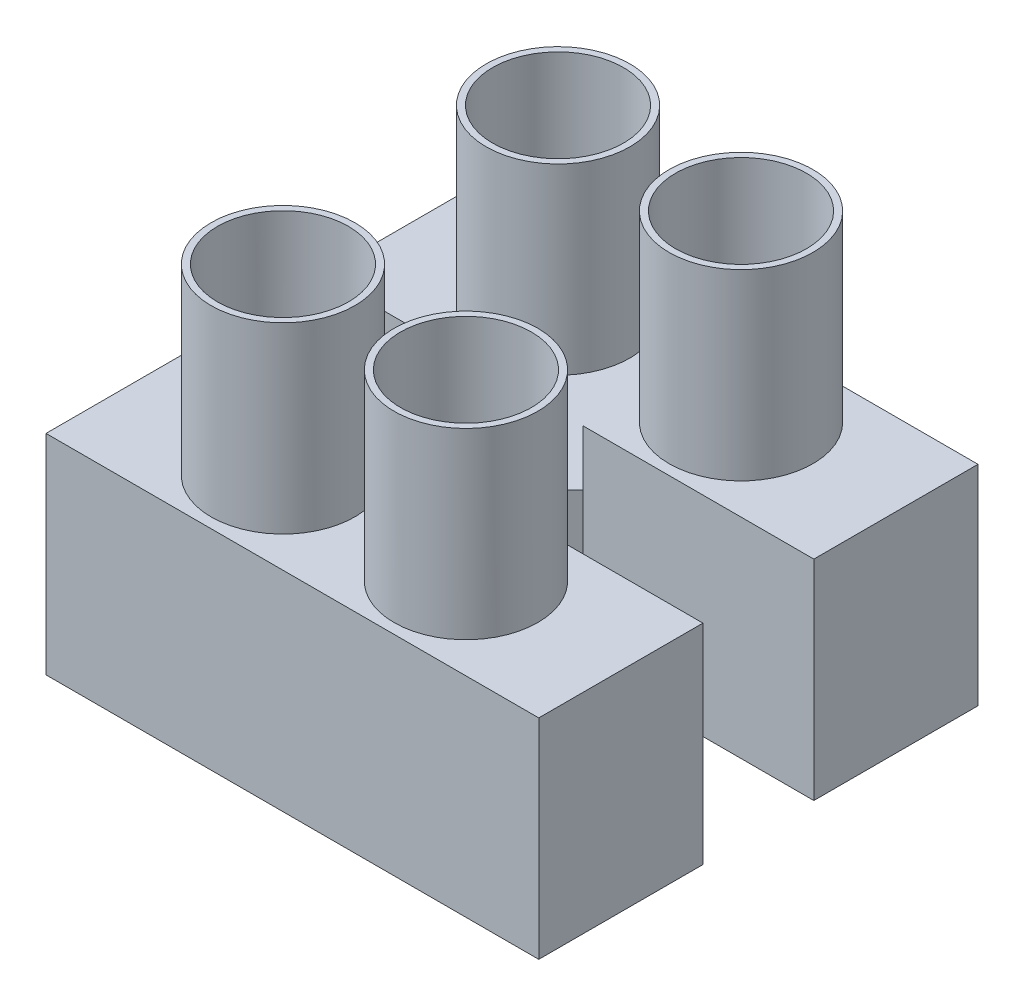
ISO-10303-21;
HEADER;
FILE_DESCRIPTION(('STEP AP214'),'2;1');
FILE_NAME('part.step','',(''),(''),'','','');
FILE_SCHEMA(('AUTOMOTIVE_DESIGN { 1 0 10303 214 1 1 1 1 }'));
ENDSEC;
DATA;
#1=APPLICATION_CONTEXT('core data for automotive mechanical design processes');
#2=APPLICATION_PROTOCOL_DEFINITION('international standard','automotive_design',2000,#1);
#3=PRODUCT_CONTEXT('',#1,'mechanical');
#4=PRODUCT('Part','Part','',(#3));
#5=PRODUCT_RELATED_PRODUCT_CATEGORY('part','',(#4));
#6=PRODUCT_DEFINITION_FORMATION('','',#4);
#7=PRODUCT_DEFINITION_CONTEXT('part definition',#1,'design');
#8=PRODUCT_DEFINITION('design','',#6,#7);
#9=PRODUCT_DEFINITION_SHAPE('','',#8);
#10=(LENGTH_UNIT() NAMED_UNIT(*) SI_UNIT(.MILLI.,.METRE.));
#11=(NAMED_UNIT(*) PLANE_ANGLE_UNIT() SI_UNIT($,.RADIAN.));
#12=(NAMED_UNIT(*) SI_UNIT($,.STERADIAN.) SOLID_ANGLE_UNIT());
#13=UNCERTAINTY_MEASURE_WITH_UNIT(LENGTH_MEASURE(1.E-05),#10,'distance_accuracy_value','');
#14=(GEOMETRIC_REPRESENTATION_CONTEXT(3) GLOBAL_UNCERTAINTY_ASSIGNED_CONTEXT((#13)) GLOBAL_UNIT_ASSIGNED_CONTEXT((#10,
#11,#12)) REPRESENTATION_CONTEXT('',''));
#15=CARTESIAN_POINT('',(0.,0.,0.));
#16=DIRECTION('',(0.,0.,1.));
#17=DIRECTION('',(1.,0.,0.));
#18=AXIS2_PLACEMENT_3D('',#15,#16,#17);
#19=CARTESIAN_POINT('',(0.,8.,-8.67493798441658));
#20=DIRECTION('',(0.,0.,-1.));
#21=DIRECTION('',(-1.,0.,0.));
#22=AXIS2_PLACEMENT_3D('',#19,#20,#21);
#23=PLANE('',#22);
#24=DIRECTION('',(0.,-1.,0.));
#25=VECTOR('',#24,1.);
#26=CARTESIAN_POINT('',(0.345270270270276,8.,-8.67493798441658));
#27=LINE('',#26,#25);
#28=CARTESIAN_POINT('',(0.345270270270276,8.,-8.67493798441658));
#29=VERTEX_POINT('',#28);
#30=CARTESIAN_POINT('',(0.345270270270276,0.,-8.67493798441658));
#31=VERTEX_POINT('',#30);
#32=EDGE_CURVE('E235',#29,#31,#27,.T.);
#33=ORIENTED_EDGE('',*,*,#32,.T.);
#34=DIRECTION('',(1.,0.,0.));
#35=VECTOR('',#34,1.);
#36=CARTESIAN_POINT('',(0.,0.,-8.67493798441658));
#37=LINE('',#36,#35);
#38=CARTESIAN_POINT('',(9.17027027027028,0.,-8.67493798441658));
#39=VERTEX_POINT('',#38);
#40=EDGE_CURVE('E264',#31,#39,#37,.T.);
#41=ORIENTED_EDGE('',*,*,#40,.T.);
#42=DIRECTION('',(0.,-1.,0.));
#43=VECTOR('',#42,1.);
#44=CARTESIAN_POINT('',(9.17027027027028,8.,-8.67493798441658));
#45=LINE('',#44,#43);
#46=CARTESIAN_POINT('',(9.17027027027028,8.,-8.67493798441658));
#47=VERTEX_POINT('',#46);
#48=EDGE_CURVE('E276',#47,#39,#45,.T.);
#49=ORIENTED_EDGE('',*,*,#48,.F.);
#50=DIRECTION('',(1.,0.,0.));
#51=VECTOR('',#50,1.);
#52=CARTESIAN_POINT('',(0.,8.,-8.67493798441658));
#53=LINE('',#52,#51);
#54=EDGE_CURVE('E90',#29,#47,#53,.T.);
#55=ORIENTED_EDGE('',*,*,#54,.F.);
#56=EDGE_LOOP('',(#33,#41,#49,#55));
#57=FACE_BOUND('',#56,.T.);
#58=ADVANCED_FACE('F73',(#57),#23,.F.);
#59=CARTESIAN_POINT('',(-9.67972972972973,8.,-4.4322972972973));
#60=DIRECTION('',(0.,0.,-1.));
#61=DIRECTION('',(-1.,0.,0.));
#62=AXIS2_PLACEMENT_3D('',#59,#60,#61);
#63=PLANE('',#62);
#64=DIRECTION('',(1.,0.,0.));
#65=VECTOR('',#64,1.);
#66=CARTESIAN_POINT('',(-9.67972972972973,8.,-4.4322972972973));
#67=LINE('',#66,#65);
#68=CARTESIAN_POINT('',(-9.67972972972973,8.,-4.4322972972973));
#69=VERTEX_POINT('',#68);
#70=CARTESIAN_POINT('',(-0.854729729729725,8.,-4.4322972972973));
#71=VERTEX_POINT('',#70);
#72=EDGE_CURVE('E320',#69,#71,#67,.T.);
#73=ORIENTED_EDGE('',*,*,#72,.T.);
#74=DIRECTION('',(0.,-1.,0.));
#75=VECTOR('',#74,1.);
#76=CARTESIAN_POINT('',(-0.854729729729725,8.,-4.4322972972973));
#77=LINE('',#76,#75);
#78=CARTESIAN_POINT('',(-0.854729729729725,0.,-4.4322972972973));
#79=VERTEX_POINT('',#78);
#80=EDGE_CURVE('E303',#71,#79,#77,.T.);
#81=ORIENTED_EDGE('',*,*,#80,.T.);
#82=DIRECTION('',(1.,0.,0.));
#83=VECTOR('',#82,1.);
#84=CARTESIAN_POINT('',(-9.67972972972973,0.,-4.4322972972973));
#85=LINE('',#84,#83);
#86=CARTESIAN_POINT('',(-9.67972972972973,0.,-4.4322972972973));
#87=VERTEX_POINT('',#86);
#88=EDGE_CURVE('E314',#87,#79,#85,.T.);
#89=ORIENTED_EDGE('',*,*,#88,.F.);
#90=DIRECTION('',(0.,-1.,0.));
#91=VECTOR('',#90,1.);
#92=CARTESIAN_POINT('',(-9.67972972972973,8.,-4.4322972972973));
#93=LINE('',#92,#91);
#94=EDGE_CURVE('E323',#69,#87,#93,.T.);
#95=ORIENTED_EDGE('',*,*,#94,.F.);
#96=EDGE_LOOP('',(#73,#81,#89,#95));
#97=FACE_BOUND('',#96,.T.);
#98=ADVANCED_FACE('F418',(#97),#63,.T.);
#99=CARTESIAN_POINT('',(-9.67972972972973,8.,-4.4322972972973));
#100=DIRECTION('',(1.,0.,0.));
#101=DIRECTION('',(0.,0.,-1.));
#102=AXIS2_PLACEMENT_3D('',#99,#100,#101);
#103=PLANE('',#102);
#104=DIRECTION('',(0.,0.,1.));
#105=VECTOR('',#104,1.);
#106=CARTESIAN_POINT('',(-9.67972972972973,0.,-4.4322972972973));
#107=LINE('',#106,#105);
#108=CARTESIAN_POINT('',(-9.67972972972973,0.,1.8477027027027));
#109=VERTEX_POINT('',#108);
#110=EDGE_CURVE('E309',#87,#109,#107,.T.);
#111=ORIENTED_EDGE('',*,*,#110,.T.);
#112=DIRECTION('',(0.,-1.,0.));
#113=VECTOR('',#112,1.);
#114=CARTESIAN_POINT('',(-9.67972972972973,8.,1.8477027027027));
#115=LINE('',#114,#113);
#116=CARTESIAN_POINT('',(-9.67972972972973,8.,1.8477027027027));
#117=VERTEX_POINT('',#116);
#118=EDGE_CURVE('E77',#117,#109,#115,.T.);
#119=ORIENTED_EDGE('',*,*,#118,.F.);
#120=DIRECTION('',(0.,0.,1.));
#121=VECTOR('',#120,1.);
#122=CARTESIAN_POINT('',(-9.67972972972973,8.,-4.4322972972973));
#123=LINE('',#122,#121);
#124=EDGE_CURVE('E310',#69,#117,#123,.T.);
#125=ORIENTED_EDGE('',*,*,#124,.F.);
#126=ORIENTED_EDGE('',*,*,#94,.T.);
#127=EDGE_LOOP('',(#111,#119,#125,#126));
#128=FACE_BOUND('',#127,.T.);
#129=ADVANCED_FACE('F75',(#128),#103,.F.);
#130=CARTESIAN_POINT('',(-9.67972972972973,8.,1.8477027027027));
#131=DIRECTION('',(0.,0.,-1.));
#132=DIRECTION('',(-1.,0.,0.));
#133=AXIS2_PLACEMENT_3D('',#130,#131,#132);
#134=PLANE('',#133);
#135=DIRECTION('',(1.,0.,0.));
#136=VECTOR('',#135,1.);
#137=CARTESIAN_POINT('',(-9.67972972972973,0.,1.8477027027027));
#138=LINE('',#137,#136);
#139=CARTESIAN_POINT('',(9.17027027027028,0.,1.8477027027027));
#140=VERTEX_POINT('',#139);
#141=EDGE_CURVE('E326',#109,#140,#138,.T.);
#142=ORIENTED_EDGE('',*,*,#141,.T.);
#143=DIRECTION('',(0.,-1.,0.));
#144=VECTOR('',#143,1.);
#145=CARTESIAN_POINT('',(9.17027027027028,8.,1.8477027027027));
#146=LINE('',#145,#144);
#147=CARTESIAN_POINT('',(9.17027027027028,8.,1.8477027027027));
#148=VERTEX_POINT('',#147);
#149=EDGE_CURVE('E338',#148,#140,#146,.T.);
#150=ORIENTED_EDGE('',*,*,#149,.F.);
#151=DIRECTION('',(1.,0.,0.));
#152=VECTOR('',#151,1.);
#153=CARTESIAN_POINT('',(-9.67972972972973,8.,1.8477027027027));
#154=LINE('',#153,#152);
#155=EDGE_CURVE('E313',#117,#148,#154,.T.);
#156=ORIENTED_EDGE('',*,*,#155,.F.);
#157=ORIENTED_EDGE('',*,*,#118,.T.);
#158=EDGE_LOOP('',(#142,#150,#156,#157));
#159=FACE_BOUND('',#158,.T.);
#160=ADVANCED_FACE('F464',(#159),#134,.F.);
#161=CARTESIAN_POINT('',(9.17027027027028,8.,-4.4322972972973));
#162=DIRECTION('',(1.,0.,0.));
#163=DIRECTION('',(0.,0.,-1.));
#164=AXIS2_PLACEMENT_3D('',#161,#162,#163);
#165=PLANE('',#164);
#166=DIRECTION('',(0.,0.,1.));
#167=VECTOR('',#166,1.);
#168=CARTESIAN_POINT('',(9.17027027027028,0.,-4.4322972972973));
#169=LINE('',#168,#167);
#170=CARTESIAN_POINT('',(9.17027027027028,0.,-4.4322972972973));
#171=VERTEX_POINT('',#170);
#172=EDGE_CURVE('E329',#171,#140,#169,.T.);
#173=ORIENTED_EDGE('',*,*,#172,.F.);
#174=DIRECTION('',(0.,-1.,0.));
#175=VECTOR('',#174,1.);
#176=CARTESIAN_POINT('',(9.17027027027028,8.,-4.4322972972973));
#177=LINE('',#176,#175);
#178=CARTESIAN_POINT('',(9.17027027027028,8.,-4.4322972972973));
#179=VERTEX_POINT('',#178);
#180=EDGE_CURVE('E336',#179,#171,#177,.T.);
#181=ORIENTED_EDGE('',*,*,#180,.F.);
#182=DIRECTION('',(0.,0.,1.));
#183=VECTOR('',#182,1.);
#184=CARTESIAN_POINT('',(9.17027027027028,8.,-4.4322972972973));
#185=LINE('',#184,#183);
#186=EDGE_CURVE('E316',#179,#148,#185,.T.);
#187=ORIENTED_EDGE('',*,*,#186,.T.);
#188=ORIENTED_EDGE('',*,*,#149,.T.);
#189=EDGE_LOOP('',(#173,#181,#187,#188));
#190=FACE_BOUND('',#189,.T.);
#191=ADVANCED_FACE('F467',(#190),#165,.T.);
#192=DIRECTION('',(0.,-1.,0.));
#193=VECTOR('',#192,1.);
#194=CARTESIAN_POINT('',(0.345270270270275,8.,-4.4322972972973));
#195=LINE('',#194,#193);
#196=CARTESIAN_POINT('',(0.345270270270275,8.,-4.4322972972973));
#197=VERTEX_POINT('',#196);
#198=CARTESIAN_POINT('',(0.345270270270275,0.,-4.4322972972973));
#199=VERTEX_POINT('',#198);
#200=EDGE_CURVE('E223',#197,#199,#195,.T.);
#201=ORIENTED_EDGE('',*,*,#200,.F.);
#202=EDGE_CURVE('E319',#197,#179,#67,.T.);
#203=ORIENTED_EDGE('',*,*,#202,.T.);
#204=ORIENTED_EDGE('',*,*,#180,.T.);
#205=EDGE_CURVE('E332',#199,#171,#85,.T.);
#206=ORIENTED_EDGE('',*,*,#205,.F.);
#207=EDGE_LOOP('',(#201,#203,#204,#206));
#208=FACE_BOUND('',#207,.T.);
#209=ADVANCED_FACE('F426',(#208),#63,.T.);
#210=CARTESIAN_POINT('',(0.,8.,0.));
#211=DIRECTION('',(0.,1.,0.));
#212=DIRECTION('',(0.,0.,1.));
#213=AXIS2_PLACEMENT_3D('',#210,#211,#212);
#214=PLANE('',#213);
#215=CARTESIAN_POINT('',(-3.75472972972973,8.,-1.2922972972973));
#216=DIRECTION('',(0.,1.,0.));
#217=DIRECTION('',(0.,0.,1.));
#218=AXIS2_PLACEMENT_3D('',#215,#216,#217);
#219=CIRCLE('',#218,2.75);
#220=CARTESIAN_POINT('',(-3.75472972972973,8.,1.4577027027027));
#221=VERTEX_POINT('',#220);
#222=EDGE_CURVE('E387',#221,#221,#219,.F.);
#223=ORIENTED_EDGE('',*,*,#222,.T.);
#224=EDGE_LOOP('',(#223));
#225=FACE_BOUND('',#224,.T.);
#226=CARTESIAN_POINT('',(3.24527027027027,8.,-1.29229729729729));
#227=DIRECTION('',(0.,1.,0.));
#228=DIRECTION('',(0.,0.,1.));
#229=AXIS2_PLACEMENT_3D('',#226,#227,#228);
#230=CIRCLE('',#229,2.75);
#231=CARTESIAN_POINT('',(3.24527027027027,8.,1.45770270270271));
#232=VERTEX_POINT('',#231);
#233=EDGE_CURVE('E82',#232,#232,#230,.T.);
#234=ORIENTED_EDGE('',*,*,#233,.F.);
#235=EDGE_LOOP('',(#234));
#236=FACE_BOUND('',#235,.T.);
#237=CARTESIAN_POINT('',(-3.75472972972973,8.,-11.8149379844166));
#238=DIRECTION('',(0.,1.,0.));
#239=DIRECTION('',(0.,0.,1.));
#240=AXIS2_PLACEMENT_3D('',#237,#238,#239);
#241=CIRCLE('',#240,2.75);
#242=CARTESIAN_POINT('',(-3.75472972972973,8.,-9.06493798441658));
#243=VERTEX_POINT('',#242);
#244=EDGE_CURVE('E347',#243,#243,#241,.T.);
#245=ORIENTED_EDGE('',*,*,#244,.F.);
#246=EDGE_LOOP('',(#245));
#247=FACE_BOUND('',#246,.T.);
#248=CARTESIAN_POINT('',(3.24527027027027,8.,-11.8149379844166));
#249=DIRECTION('',(0.,1.,0.));
#250=DIRECTION('',(0.,0.,1.));
#251=AXIS2_PLACEMENT_3D('',#248,#249,#250);
#252=CIRCLE('',#251,2.75);
#253=CARTESIAN_POINT('',(3.24527027027027,8.,-9.06493798441658));
#254=VERTEX_POINT('',#253);
#255=EDGE_CURVE('E238',#254,#254,#252,.F.);
#256=ORIENTED_EDGE('',*,*,#255,.T.);
#257=EDGE_LOOP('',(#256));
#258=FACE_BOUND('',#257,.T.);
#259=ORIENTED_EDGE('',*,*,#202,.F.);
#260=DIRECTION('',(-0.707106781186547,0.,0.707106781186548));
#261=VECTOR('',#260,1.);
#262=CARTESIAN_POINT('',(-2.04351351351351,8.,-2.04351351351351));
#263=LINE('',#262,#261);
#264=CARTESIAN_POINT('',(2.46659061382992,8.,-6.55361764085694));
#265=VERTEX_POINT('',#264);
#266=EDGE_CURVE('E228',#265,#197,#263,.T.);
#267=ORIENTED_EDGE('',*,*,#266,.F.);
#268=DIRECTION('',(-0.707106781186547,0.,-0.707106781186548));
#269=VECTOR('',#268,1.);
#270=CARTESIAN_POINT('',(4.51010412734343,8.,-4.51010412734343));
#271=LINE('',#270,#269);
#272=EDGE_CURVE('E230',#265,#29,#271,.T.);
#273=ORIENTED_EDGE('',*,*,#272,.T.);
#274=ORIENTED_EDGE('',*,*,#54,.T.);
#275=DIRECTION('',(0.,0.,-1.));
#276=VECTOR('',#275,1.);
#277=CARTESIAN_POINT('',(9.17027027027028,8.,0.));
#278=LINE('',#277,#276);
#279=CARTESIAN_POINT('',(9.17027027027028,8.,-14.9549379844166));
#280=VERTEX_POINT('',#279);
#281=EDGE_CURVE('E256',#47,#280,#278,.T.);
#282=ORIENTED_EDGE('',*,*,#281,.T.);
#283=DIRECTION('',(1.,0.,0.));
#284=VECTOR('',#283,1.);
#285=CARTESIAN_POINT('',(0.,8.,-14.9549379844166));
#286=LINE('',#285,#284);
#287=CARTESIAN_POINT('',(-9.67972972972973,8.,-14.9549379844166));
#288=VERTEX_POINT('',#287);
#289=EDGE_CURVE('E258',#288,#280,#286,.T.);
#290=ORIENTED_EDGE('',*,*,#289,.F.);
#291=DIRECTION('',(0.,0.,-1.));
#292=VECTOR('',#291,1.);
#293=CARTESIAN_POINT('',(-9.67972972972973,8.,0.));
#294=LINE('',#293,#292);
#295=CARTESIAN_POINT('',(-9.67972972972973,8.,-8.67493798441658));
#296=VERTEX_POINT('',#295);
#297=EDGE_CURVE('E249',#296,#288,#294,.T.);
#298=ORIENTED_EDGE('',*,*,#297,.F.);
#299=CARTESIAN_POINT('',(-0.854729729729725,8.,-8.67493798441658));
#300=VERTEX_POINT('',#299);
#301=EDGE_CURVE('E253',#296,#300,#53,.T.);
#302=ORIENTED_EDGE('',*,*,#301,.T.);
#303=DIRECTION('',(0.707106781186547,0.,-0.707106781186548));
#304=VECTOR('',#303,1.);
#305=CARTESIAN_POINT('',(-4.76483385707315,8.,-4.76483385707315));
#306=LINE('',#305,#304);
#307=CARTESIAN_POINT('',(-2.97605007328937,8.,-6.55361764085694));
#308=VERTEX_POINT('',#307);
#309=EDGE_CURVE('E282',#308,#300,#306,.T.);
#310=ORIENTED_EDGE('',*,*,#309,.F.);
#311=DIRECTION('',(0.707106781186547,0.,0.707106781186548));
#312=VECTOR('',#311,1.);
#313=CARTESIAN_POINT('',(1.78878378378378,8.,-1.78878378378378));
#314=LINE('',#313,#312);
#315=EDGE_CURVE('E284',#308,#71,#314,.T.);
#316=ORIENTED_EDGE('',*,*,#315,.T.);
#317=ORIENTED_EDGE('',*,*,#72,.F.);
#318=ORIENTED_EDGE('',*,*,#124,.T.);
#319=ORIENTED_EDGE('',*,*,#155,.T.);
#320=ORIENTED_EDGE('',*,*,#186,.F.);
#321=EDGE_LOOP('',(#259,#267,#273,#274,#282,#290,#298,#302,#310,#316,#317,#318,#319,#320));
#322=FACE_BOUND('',#321,.T.);
#323=DIRECTION('',(0.707106781186547,0.,-0.707106781186548));
#324=VECTOR('',#323,1.);
#325=CARTESIAN_POINT('',(-2.34351351351351,8.,-2.34351351351351));
#326=LINE('',#325,#324);
#327=CARTESIAN_POINT('',(-0.254729729729725,8.,-4.4322972972973));
#328=VERTEX_POINT('',#327);
#329=CARTESIAN_POINT('',(1.86659061382992,8.,-6.55361764085694));
#330=VERTEX_POINT('',#329);
#331=EDGE_CURVE('E207',#328,#330,#326,.T.);
#332=ORIENTED_EDGE('',*,*,#331,.F.);
#333=DIRECTION('',(-0.707106781186547,0.,-0.707106781186548));
#334=VECTOR('',#333,1.);
#335=CARTESIAN_POINT('',(2.08878378378379,8.,-2.08878378378378));
#336=LINE('',#335,#334);
#337=CARTESIAN_POINT('',(-2.37605007328937,8.,-6.55361764085694));
#338=VERTEX_POINT('',#337);
#339=EDGE_CURVE('E287',#328,#338,#336,.T.);
#340=ORIENTED_EDGE('',*,*,#339,.T.);
#341=DIRECTION('',(-0.707106781186548,0.,0.707106781186548));
#342=VECTOR('',#341,1.);
#343=CARTESIAN_POINT('',(-4.46483385707315,8.,-4.46483385707315));
#344=LINE('',#343,#342);
#345=CARTESIAN_POINT('',(-0.254729729729725,8.,-8.67493798441658));
#346=VERTEX_POINT('',#345);
#347=EDGE_CURVE('E210',#346,#338,#344,.T.);
#348=ORIENTED_EDGE('',*,*,#347,.F.);
#349=DIRECTION('',(0.707106781186548,0.,0.707106781186548));
#350=VECTOR('',#349,1.);
#351=CARTESIAN_POINT('',(4.21010412734343,8.,-4.21010412734343));
#352=LINE('',#351,#350);
#353=EDGE_CURVE('E203',#346,#330,#352,.T.);
#354=ORIENTED_EDGE('',*,*,#353,.T.);
#355=EDGE_LOOP('',(#332,#340,#348,#354));
#356=FACE_BOUND('',#355,.T.);
#357=ADVANCED_FACE('F205',(#225,#236,#247,#258,#322,#356),#214,.T.);
#358=CARTESIAN_POINT('',(0.,0.,0.));
#359=DIRECTION('',(0.,1.,0.));
#360=DIRECTION('',(0.,0.,1.));
#361=AXIS2_PLACEMENT_3D('',#358,#359,#360);
#362=PLANE('',#361);
#363=DIRECTION('',(-0.707106781186547,0.,0.707106781186548));
#364=VECTOR('',#363,1.);
#365=CARTESIAN_POINT('',(-2.04351351351351,0.,-2.04351351351351));
#366=LINE('',#365,#364);
#367=CARTESIAN_POINT('',(2.46659061382992,0.,-6.55361764085694));
#368=VERTEX_POINT('',#367);
#369=EDGE_CURVE('E240',#368,#199,#366,.T.);
#370=ORIENTED_EDGE('',*,*,#369,.T.);
#371=ORIENTED_EDGE('',*,*,#205,.T.);
#372=ORIENTED_EDGE('',*,*,#172,.T.);
#373=ORIENTED_EDGE('',*,*,#141,.F.);
#374=ORIENTED_EDGE('',*,*,#110,.F.);
#375=ORIENTED_EDGE('',*,*,#88,.T.);
#376=DIRECTION('',(0.707106781186547,0.,0.707106781186548));
#377=VECTOR('',#376,1.);
#378=CARTESIAN_POINT('',(1.78878378378378,0.,-1.78878378378378));
#379=LINE('',#378,#377);
#380=CARTESIAN_POINT('',(-2.97605007328937,0.,-6.55361764085694));
#381=VERTEX_POINT('',#380);
#382=EDGE_CURVE('E98',#381,#79,#379,.T.);
#383=ORIENTED_EDGE('',*,*,#382,.F.);
#384=DIRECTION('',(0.707106781186547,0.,-0.707106781186548));
#385=VECTOR('',#384,1.);
#386=CARTESIAN_POINT('',(-4.76483385707315,0.,-4.76483385707315));
#387=LINE('',#386,#385);
#388=CARTESIAN_POINT('',(-0.854729729729725,0.,-8.67493798441658));
#389=VERTEX_POINT('',#388);
#390=EDGE_CURVE('E281',#381,#389,#387,.T.);
#391=ORIENTED_EDGE('',*,*,#390,.T.);
#392=CARTESIAN_POINT('',(-9.67972972972973,0.,-8.67493798441658));
#393=VERTEX_POINT('',#392);
#394=EDGE_CURVE('E265',#393,#389,#37,.T.);
#395=ORIENTED_EDGE('',*,*,#394,.F.);
#396=DIRECTION('',(0.,0.,-1.));
#397=VECTOR('',#396,1.);
#398=CARTESIAN_POINT('',(-9.67972972972973,0.,0.));
#399=LINE('',#398,#397);
#400=CARTESIAN_POINT('',(-9.67972972972973,0.,-14.9549379844166));
#401=VERTEX_POINT('',#400);
#402=EDGE_CURVE('E222',#393,#401,#399,.T.);
#403=ORIENTED_EDGE('',*,*,#402,.T.);
#404=DIRECTION('',(1.,0.,0.));
#405=VECTOR('',#404,1.);
#406=CARTESIAN_POINT('',(0.,0.,-14.9549379844166));
#407=LINE('',#406,#405);
#408=CARTESIAN_POINT('',(9.17027027027028,0.,-14.9549379844166));
#409=VERTEX_POINT('',#408);
#410=EDGE_CURVE('E252',#401,#409,#407,.T.);
#411=ORIENTED_EDGE('',*,*,#410,.T.);
#412=DIRECTION('',(0.,0.,-1.));
#413=VECTOR('',#412,1.);
#414=CARTESIAN_POINT('',(9.17027027027028,0.,0.));
#415=LINE('',#414,#413);
#416=EDGE_CURVE('E268',#39,#409,#415,.T.);
#417=ORIENTED_EDGE('',*,*,#416,.F.);
#418=ORIENTED_EDGE('',*,*,#40,.F.);
#419=DIRECTION('',(-0.707106781186547,0.,-0.707106781186548));
#420=VECTOR('',#419,1.);
#421=CARTESIAN_POINT('',(4.51010412734343,0.,-4.51010412734343));
#422=LINE('',#421,#420);
#423=EDGE_CURVE('E213',#368,#31,#422,.T.);
#424=ORIENTED_EDGE('',*,*,#423,.F.);
#425=EDGE_LOOP('',(#370,#371,#372,#373,#374,#375,#383,#391,#395,#403,#411,#417,#418,#424));
#426=FACE_BOUND('',#425,.T.);
#427=DIRECTION('',(-0.707106781186547,0.,-0.707106781186548));
#428=VECTOR('',#427,1.);
#429=CARTESIAN_POINT('',(2.08878378378379,0.,-2.08878378378378));
#430=LINE('',#429,#428);
#431=CARTESIAN_POINT('',(-0.254729729729725,0.,-4.4322972972973));
#432=VERTEX_POINT('',#431);
#433=CARTESIAN_POINT('',(-2.37605007328937,0.,-6.55361764085694));
#434=VERTEX_POINT('',#433);
#435=EDGE_CURVE('E294',#432,#434,#430,.T.);
#436=ORIENTED_EDGE('',*,*,#435,.F.);
#437=DIRECTION('',(0.707106781186547,0.,-0.707106781186548));
#438=VECTOR('',#437,1.);
#439=CARTESIAN_POINT('',(-2.34351351351351,0.,-2.34351351351351));
#440=LINE('',#439,#438);
#441=CARTESIAN_POINT('',(1.86659061382992,0.,-6.55361764085694));
#442=VERTEX_POINT('',#441);
#443=EDGE_CURVE('E237',#432,#442,#440,.T.);
#444=ORIENTED_EDGE('',*,*,#443,.T.);
#445=DIRECTION('',(0.707106781186548,0.,0.707106781186548));
#446=VECTOR('',#445,1.);
#447=CARTESIAN_POINT('',(4.21010412734343,0.,-4.21010412734343));
#448=LINE('',#447,#446);
#449=CARTESIAN_POINT('',(-0.254729729729725,0.,-8.67493798441658));
#450=VERTEX_POINT('',#449);
#451=EDGE_CURVE('E219',#450,#442,#448,.T.);
#452=ORIENTED_EDGE('',*,*,#451,.F.);
#453=DIRECTION('',(-0.707106781186548,0.,0.707106781186548));
#454=VECTOR('',#453,1.);
#455=CARTESIAN_POINT('',(-4.46483385707315,0.,-4.46483385707315));
#456=LINE('',#455,#454);
#457=EDGE_CURVE('E285',#450,#434,#456,.T.);
#458=ORIENTED_EDGE('',*,*,#457,.T.);
#459=EDGE_LOOP('',(#436,#444,#452,#458));
#460=FACE_BOUND('',#459,.T.);
#461=ADVANCED_FACE('F453',(#426,#460),#362,.F.);
#462=CARTESIAN_POINT('',(-4.76483385707315,8.,-4.76483385707315));
#463=DIRECTION('',(-0.707106781186548,0.,-0.707106781186547));
#464=DIRECTION('',(-0.707106781186547,0.,0.707106781186548));
#465=AXIS2_PLACEMENT_3D('',#462,#463,#464);
#466=PLANE('',#465);
#467=ORIENTED_EDGE('',*,*,#390,.F.);
#468=DIRECTION('',(0.,-1.,0.));
#469=VECTOR('',#468,1.);
#470=CARTESIAN_POINT('',(-2.97605007328937,8.,-6.55361764085694));
#471=LINE('',#470,#469);
#472=EDGE_CURVE('E305',#308,#381,#471,.T.);
#473=ORIENTED_EDGE('',*,*,#472,.F.);
#474=ORIENTED_EDGE('',*,*,#309,.T.);
#475=DIRECTION('',(0.,-1.,0.));
#476=VECTOR('',#475,1.);
#477=CARTESIAN_POINT('',(-0.854729729729725,8.,-8.67493798441658));
#478=LINE('',#477,#476);
#479=EDGE_CURVE('E307',#300,#389,#478,.T.);
#480=ORIENTED_EDGE('',*,*,#479,.T.);
#481=EDGE_LOOP('',(#467,#473,#474,#480));
#482=FACE_BOUND('',#481,.T.);
#483=ADVANCED_FACE('F456',(#482),#466,.T.);
#484=CARTESIAN_POINT('',(1.78878378378378,8.,-1.78878378378378));
#485=DIRECTION('',(0.707106781186548,0.,-0.707106781186547));
#486=DIRECTION('',(-0.707106781186547,0.,-0.707106781186548));
#487=AXIS2_PLACEMENT_3D('',#484,#485,#486);
#488=PLANE('',#487);
#489=ORIENTED_EDGE('',*,*,#382,.T.);
#490=ORIENTED_EDGE('',*,*,#80,.F.);
#491=ORIENTED_EDGE('',*,*,#315,.F.);
#492=ORIENTED_EDGE('',*,*,#472,.T.);
#493=EDGE_LOOP('',(#489,#490,#491,#492));
#494=FACE_BOUND('',#493,.T.);
#495=ADVANCED_FACE('F458',(#494),#488,.F.);
#496=CARTESIAN_POINT('',(2.08878378378379,8.,-2.08878378378378));
#497=DIRECTION('',(-0.707106781186548,0.,0.707106781186547));
#498=DIRECTION('',(0.707106781186547,0.,0.707106781186548));
#499=AXIS2_PLACEMENT_3D('',#496,#497,#498);
#500=PLANE('',#499);
#501=ORIENTED_EDGE('',*,*,#435,.T.);
#502=DIRECTION('',(0.,-1.,0.));
#503=VECTOR('',#502,1.);
#504=CARTESIAN_POINT('',(-2.37605007328937,8.,-6.55361764085694));
#505=LINE('',#504,#503);
#506=EDGE_CURVE('E300',#338,#434,#505,.T.);
#507=ORIENTED_EDGE('',*,*,#506,.F.);
#508=ORIENTED_EDGE('',*,*,#339,.F.);
#509=DIRECTION('',(0.,-1.,0.));
#510=VECTOR('',#509,1.);
#511=CARTESIAN_POINT('',(-0.254729729729725,8.,-4.4322972972973));
#512=LINE('',#511,#510);
#513=EDGE_CURVE('E227',#328,#432,#512,.T.);
#514=ORIENTED_EDGE('',*,*,#513,.T.);
#515=EDGE_LOOP('',(#501,#507,#508,#514));
#516=FACE_BOUND('',#515,.T.);
#517=ADVANCED_FACE('F732',(#516),#500,.F.);
#518=CARTESIAN_POINT('',(-4.46483385707315,8.,-4.46483385707315));
#519=DIRECTION('',(0.707106781186547,0.,0.707106781186547));
#520=DIRECTION('',(0.707106781186548,0.,-0.707106781186548));
#521=AXIS2_PLACEMENT_3D('',#518,#519,#520);
#522=PLANE('',#521);
#523=ORIENTED_EDGE('',*,*,#457,.F.);
#524=DIRECTION('',(0.,-1.,0.));
#525=VECTOR('',#524,1.);
#526=CARTESIAN_POINT('',(-0.254729729729725,8.,-8.67493798441658));
#527=LINE('',#526,#525);
#528=EDGE_CURVE('E290',#346,#450,#527,.T.);
#529=ORIENTED_EDGE('',*,*,#528,.F.);
#530=ORIENTED_EDGE('',*,*,#347,.T.);
#531=ORIENTED_EDGE('',*,*,#506,.T.);
#532=EDGE_LOOP('',(#523,#529,#530,#531));
#533=FACE_BOUND('',#532,.T.);
#534=ADVANCED_FACE('F439',(#533),#522,.T.);
#535=CARTESIAN_POINT('',(-9.67972972972973,8.,0.));
#536=DIRECTION('',(-1.,0.,0.));
#537=DIRECTION('',(0.,0.,1.));
#538=AXIS2_PLACEMENT_3D('',#535,#536,#537);
#539=PLANE('',#538);
#540=ORIENTED_EDGE('',*,*,#402,.F.);
#541=DIRECTION('',(0.,-1.,0.));
#542=VECTOR('',#541,1.);
#543=CARTESIAN_POINT('',(-9.67972972972973,8.,-8.67493798441658));
#544=LINE('',#543,#542);
#545=EDGE_CURVE('E279',#296,#393,#544,.T.);
#546=ORIENTED_EDGE('',*,*,#545,.F.);
#547=ORIENTED_EDGE('',*,*,#297,.T.);
#548=DIRECTION('',(0.,-1.,0.));
#549=VECTOR('',#548,1.);
#550=CARTESIAN_POINT('',(-9.67972972972973,8.,-14.9549379844166));
#551=LINE('',#550,#549);
#552=EDGE_CURVE('E261',#288,#401,#551,.T.);
#553=ORIENTED_EDGE('',*,*,#552,.T.);
#554=EDGE_LOOP('',(#540,#546,#547,#553));
#555=FACE_BOUND('',#554,.T.);
#556=ADVANCED_FACE('F431',(#555),#539,.T.);
#557=ORIENTED_EDGE('',*,*,#479,.F.);
#558=ORIENTED_EDGE('',*,*,#301,.F.);
#559=ORIENTED_EDGE('',*,*,#545,.T.);
#560=ORIENTED_EDGE('',*,*,#394,.T.);
#561=EDGE_LOOP('',(#557,#558,#559,#560));
#562=FACE_BOUND('',#561,.T.);
#563=ADVANCED_FACE('F420',(#562),#23,.F.);
#564=CARTESIAN_POINT('',(9.17027027027028,8.,0.));
#565=DIRECTION('',(-1.,0.,0.));
#566=DIRECTION('',(0.,0.,1.));
#567=AXIS2_PLACEMENT_3D('',#564,#565,#566);
#568=PLANE('',#567);
#569=ORIENTED_EDGE('',*,*,#416,.T.);
#570=DIRECTION('',(0.,-1.,0.));
#571=VECTOR('',#570,1.);
#572=CARTESIAN_POINT('',(9.17027027027028,8.,-14.9549379844166));
#573=LINE('',#572,#571);
#574=EDGE_CURVE('E274',#280,#409,#573,.T.);
#575=ORIENTED_EDGE('',*,*,#574,.F.);
#576=ORIENTED_EDGE('',*,*,#281,.F.);
#577=ORIENTED_EDGE('',*,*,#48,.T.);
#578=EDGE_LOOP('',(#569,#575,#576,#577));
#579=FACE_BOUND('',#578,.T.);
#580=ADVANCED_FACE('F430',(#579),#568,.F.);
#581=CARTESIAN_POINT('',(0.,8.,-14.9549379844166));
#582=DIRECTION('',(0.,0.,-1.));
#583=DIRECTION('',(-1.,0.,0.));
#584=AXIS2_PLACEMENT_3D('',#581,#582,#583);
#585=PLANE('',#584);
#586=ORIENTED_EDGE('',*,*,#410,.F.);
#587=ORIENTED_EDGE('',*,*,#552,.F.);
#588=ORIENTED_EDGE('',*,*,#289,.T.);
#589=ORIENTED_EDGE('',*,*,#574,.T.);
#590=EDGE_LOOP('',(#586,#587,#588,#589));
#591=FACE_BOUND('',#590,.T.);
#592=ADVANCED_FACE('F437',(#591),#585,.T.);
#593=CARTESIAN_POINT('',(4.21010412734343,8.,-4.21010412734343));
#594=DIRECTION('',(0.707106781186547,0.,-0.707106781186547));
#595=DIRECTION('',(-0.707106781186548,0.,-0.707106781186548));
#596=AXIS2_PLACEMENT_3D('',#593,#594,#595);
#597=PLANE('',#596);
#598=ORIENTED_EDGE('',*,*,#451,.T.);
#599=DIRECTION('',(0.,-1.,0.));
#600=VECTOR('',#599,1.);
#601=CARTESIAN_POINT('',(1.86659061382992,8.,-6.55361764085694));
#602=LINE('',#601,#600);
#603=EDGE_CURVE('E216',#330,#442,#602,.T.);
#604=ORIENTED_EDGE('',*,*,#603,.F.);
#605=ORIENTED_EDGE('',*,*,#353,.F.);
#606=ORIENTED_EDGE('',*,*,#528,.T.);
#607=EDGE_LOOP('',(#598,#604,#605,#606));
#608=FACE_BOUND('',#607,.T.);
#609=ADVANCED_FACE('F217',(#608),#597,.F.);
#610=CARTESIAN_POINT('',(-2.34351351351351,8.,-2.34351351351351));
#611=DIRECTION('',(-0.707106781186548,0.,-0.707106781186547));
#612=DIRECTION('',(-0.707106781186547,0.,0.707106781186548));
#613=AXIS2_PLACEMENT_3D('',#610,#611,#612);
#614=PLANE('',#613);
#615=ORIENTED_EDGE('',*,*,#443,.F.);
#616=ORIENTED_EDGE('',*,*,#513,.F.);
#617=ORIENTED_EDGE('',*,*,#331,.T.);
#618=ORIENTED_EDGE('',*,*,#603,.T.);
#619=EDGE_LOOP('',(#615,#616,#617,#618));
#620=FACE_BOUND('',#619,.T.);
#621=ADVANCED_FACE('F225',(#620),#614,.T.);
#622=CARTESIAN_POINT('',(-2.04351351351351,8.,-2.04351351351351));
#623=DIRECTION('',(0.707106781186548,0.,0.707106781186547));
#624=DIRECTION('',(0.707106781186547,0.,-0.707106781186548));
#625=AXIS2_PLACEMENT_3D('',#622,#623,#624);
#626=PLANE('',#625);
#627=ORIENTED_EDGE('',*,*,#369,.F.);
#628=DIRECTION('',(0.,-1.,0.));
#629=VECTOR('',#628,1.);
#630=CARTESIAN_POINT('',(2.46659061382992,8.,-6.55361764085694));
#631=LINE('',#630,#629);
#632=EDGE_CURVE('E246',#265,#368,#631,.T.);
#633=ORIENTED_EDGE('',*,*,#632,.F.);
#634=ORIENTED_EDGE('',*,*,#266,.T.);
#635=ORIENTED_EDGE('',*,*,#200,.T.);
#636=EDGE_LOOP('',(#627,#633,#634,#635));
#637=FACE_BOUND('',#636,.T.);
#638=ADVANCED_FACE('F474',(#637),#626,.T.);
#639=CARTESIAN_POINT('',(4.51010412734343,8.,-4.51010412734343));
#640=DIRECTION('',(-0.707106781186548,0.,0.707106781186547));
#641=DIRECTION('',(0.707106781186547,0.,0.707106781186548));
#642=AXIS2_PLACEMENT_3D('',#639,#640,#641);
#643=PLANE('',#642);
#644=ORIENTED_EDGE('',*,*,#423,.T.);
#645=ORIENTED_EDGE('',*,*,#32,.F.);
#646=ORIENTED_EDGE('',*,*,#272,.F.);
#647=ORIENTED_EDGE('',*,*,#632,.T.);
#648=EDGE_LOOP('',(#644,#645,#646,#647));
#649=FACE_BOUND('',#648,.T.);
#650=ADVANCED_FACE('F479',(#649),#643,.F.);
#651=CARTESIAN_POINT('',(3.24527027027027,15.,-11.8149379844166));
#652=DIRECTION('',(0.,1.,0.));
#653=DIRECTION('',(0.,0.,1.));
#654=AXIS2_PLACEMENT_3D('',#651,#652,#653);
#655=PLANE('',#654);
#656=CARTESIAN_POINT('',(3.24527027027027,15.,-11.8149379844166));
#657=DIRECTION('',(0.,1.,0.));
#658=DIRECTION('',(0.,0.,1.));
#659=AXIS2_PLACEMENT_3D('',#656,#657,#658);
#660=CIRCLE('',#659,2.75);
#661=CARTESIAN_POINT('',(3.24527027027027,15.,-9.06493798441658));
#662=VERTEX_POINT('',#661);
#663=EDGE_CURVE('E354',#662,#662,#660,.T.);
#664=ORIENTED_EDGE('',*,*,#663,.T.);
#665=EDGE_LOOP('',(#664));
#666=FACE_BOUND('',#665,.T.);
#667=CARTESIAN_POINT('',(3.24527027027027,15.,-11.8149379844166));
#668=DIRECTION('',(0.,1.,0.));
#669=DIRECTION('',(0.,0.,1.));
#670=AXIS2_PLACEMENT_3D('',#667,#668,#669);
#671=CIRCLE('',#670,2.50501286667895);
#672=CARTESIAN_POINT('',(3.24527027027027,15.,-9.30992511773764));
#673=VERTEX_POINT('',#672);
#674=EDGE_CURVE('E360',#673,#673,#671,.T.);
#675=ORIENTED_EDGE('',*,*,#674,.F.);
#676=EDGE_LOOP('',(#675));
#677=FACE_BOUND('',#676,.T.);
#678=ADVANCED_FACE('F497',(#666,#677),#655,.T.);
#679=CARTESIAN_POINT('',(3.24527027027027,15.,-11.8149379844166));
#680=DIRECTION('',(0.,-1.,0.));
#681=DIRECTION('',(0.,0.,-1.));
#682=AXIS2_PLACEMENT_3D('',#679,#680,#681);
#683=CYLINDRICAL_SURFACE('',#682,2.75);
#684=ORIENTED_EDGE('',*,*,#255,.F.);
#685=EDGE_LOOP('',(#684));
#686=FACE_BOUND('',#685,.T.);
#687=ORIENTED_EDGE('',*,*,#663,.F.);
#688=EDGE_LOOP('',(#687));
#689=FACE_BOUND('',#688,.T.);
#690=ADVANCED_FACE('F498',(#686,#689),#683,.T.);
#691=CARTESIAN_POINT('',(3.24527027027027,15.,-11.8149379844166));
#692=DIRECTION('',(0.,-1.,0.));
#693=DIRECTION('',(0.,0.,-1.));
#694=AXIS2_PLACEMENT_3D('',#691,#692,#693);
#695=CYLINDRICAL_SURFACE('',#694,2.50501286667895);
#696=CARTESIAN_POINT('',(3.24527027027027,8.,-11.8149379844166));
#697=DIRECTION('',(0.,1.,0.));
#698=DIRECTION('',(0.,0.,1.));
#699=AXIS2_PLACEMENT_3D('',#696,#697,#698);
#700=CIRCLE('',#699,2.50501286667895);
#701=CARTESIAN_POINT('',(3.24527027027027,8.,-9.30992511773764));
#702=VERTEX_POINT('',#701);
#703=EDGE_CURVE('E343',#702,#702,#700,.F.);
#704=ORIENTED_EDGE('',*,*,#703,.T.);
#705=EDGE_LOOP('',(#704));
#706=FACE_BOUND('',#705,.T.);
#707=ORIENTED_EDGE('',*,*,#674,.T.);
#708=EDGE_LOOP('',(#707));
#709=FACE_BOUND('',#708,.T.);
#710=ADVANCED_FACE('F501',(#706,#709),#695,.F.);
#711=ORIENTED_EDGE('',*,*,#703,.F.);
#712=EDGE_LOOP('',(#711));
#713=FACE_BOUND('',#712,.T.);
#714=ADVANCED_FACE('F507',(#713),#214,.T.);
#715=CARTESIAN_POINT('',(-3.75472972972973,15.,-11.8149379844166));
#716=DIRECTION('',(0.,-1.,0.));
#717=DIRECTION('',(1.,0.,0.));
#718=AXIS2_PLACEMENT_3D('',#715,#716,#717);
#719=CYLINDRICAL_SURFACE('',#718,2.75);
#720=ORIENTED_EDGE('',*,*,#244,.T.);
#721=EDGE_LOOP('',(#720));
#722=FACE_BOUND('',#721,.T.);
#723=CARTESIAN_POINT('',(-3.75472972972973,15.,-11.8149379844166));
#724=DIRECTION('',(0.,-1.,0.));
#725=DIRECTION('',(0.,0.,1.));
#726=AXIS2_PLACEMENT_3D('',#723,#724,#725);
#727=CIRCLE('',#726,2.75);
#728=CARTESIAN_POINT('',(-3.75472972972972,15.,-9.06493798441658));
#729=VERTEX_POINT('',#728);
#730=EDGE_CURVE('E368',#729,#729,#727,.T.);
#731=ORIENTED_EDGE('',*,*,#730,.T.);
#732=EDGE_LOOP('',(#731));
#733=FACE_BOUND('',#732,.T.);
#734=ADVANCED_FACE('F508',(#722,#733),#719,.T.);
#735=CARTESIAN_POINT('',(-3.75472972972973,15.,-11.8149379844166));
#736=DIRECTION('',(0.,1.,0.));
#737=DIRECTION('',(0.,0.,1.));
#738=AXIS2_PLACEMENT_3D('',#735,#736,#737);
#739=PLANE('',#738);
#740=CARTESIAN_POINT('',(-3.75472972972973,15.,-11.8149379844166));
#741=DIRECTION('',(0.,-1.,0.));
#742=DIRECTION('',(0.,0.,1.));
#743=AXIS2_PLACEMENT_3D('',#740,#741,#742);
#744=CIRCLE('',#743,2.50501286667895);
#745=CARTESIAN_POINT('',(-3.75472972972972,15.,-9.30992511773764));
#746=VERTEX_POINT('',#745);
#747=EDGE_CURVE('E373',#746,#746,#744,.T.);
#748=ORIENTED_EDGE('',*,*,#747,.T.);
#749=EDGE_LOOP('',(#748));
#750=FACE_BOUND('',#749,.T.);
#751=ORIENTED_EDGE('',*,*,#730,.F.);
#752=EDGE_LOOP('',(#751));
#753=FACE_BOUND('',#752,.T.);
#754=ADVANCED_FACE('F511',(#750,#753),#739,.T.);
#755=CARTESIAN_POINT('',(-3.75472972972973,15.,-11.8149379844166));
#756=DIRECTION('',(0.,-1.,0.));
#757=DIRECTION('',(1.,0.,0.));
#758=AXIS2_PLACEMENT_3D('',#755,#756,#757);
#759=CYLINDRICAL_SURFACE('',#758,2.50501286667895);
#760=CARTESIAN_POINT('',(-3.75472972972973,8.,-11.8149379844166));
#761=DIRECTION('',(0.,1.,0.));
#762=DIRECTION('',(0.,0.,1.));
#763=AXIS2_PLACEMENT_3D('',#760,#761,#762);
#764=CIRCLE('',#763,2.50501286667895);
#765=CARTESIAN_POINT('',(-3.75472972972973,8.,-9.30992511773764));
#766=VERTEX_POINT('',#765);
#767=EDGE_CURVE('E364',#766,#766,#764,.T.);
#768=ORIENTED_EDGE('',*,*,#767,.F.);
#769=EDGE_LOOP('',(#768));
#770=FACE_BOUND('',#769,.T.);
#771=ORIENTED_EDGE('',*,*,#747,.F.);
#772=EDGE_LOOP('',(#771));
#773=FACE_BOUND('',#772,.T.);
#774=ADVANCED_FACE('F515',(#770,#773),#759,.F.);
#775=ORIENTED_EDGE('',*,*,#767,.T.);
#776=EDGE_LOOP('',(#775));
#777=FACE_BOUND('',#776,.T.);
#778=ADVANCED_FACE('F414',(#777),#214,.T.);
#779=CARTESIAN_POINT('',(3.24527027027027,15.,-1.29229729729729));
#780=DIRECTION('',(0.,-1.,0.));
#781=DIRECTION('',(0.,0.,-1.));
#782=AXIS2_PLACEMENT_3D('',#779,#780,#781);
#783=CYLINDRICAL_SURFACE('',#782,2.75);
#784=ORIENTED_EDGE('',*,*,#233,.T.);
#785=EDGE_LOOP('',(#784));
#786=FACE_BOUND('',#785,.T.);
#787=CARTESIAN_POINT('',(3.24527027027027,15.,-1.29229729729729));
#788=DIRECTION('',(0.,-1.,0.));
#789=DIRECTION('',(0.,0.,-1.));
#790=AXIS2_PLACEMENT_3D('',#787,#788,#789);
#791=CIRCLE('',#790,2.75);
#792=CARTESIAN_POINT('',(3.24527027027027,15.,-4.04229729729729));
#793=VERTEX_POINT('',#792);
#794=EDGE_CURVE('E381',#793,#793,#791,.T.);
#795=ORIENTED_EDGE('',*,*,#794,.T.);
#796=EDGE_LOOP('',(#795));
#797=FACE_BOUND('',#796,.T.);
#798=ADVANCED_FACE('F520',(#786,#797),#783,.T.);
#799=CARTESIAN_POINT('',(3.24527027027027,15.,-1.29229729729729));
#800=DIRECTION('',(0.,1.,0.));
#801=DIRECTION('',(0.,0.,-1.));
#802=AXIS2_PLACEMENT_3D('',#799,#800,#801);
#803=PLANE('',#802);
#804=CARTESIAN_POINT('',(3.24527027027027,15.,-1.29229729729729));
#805=DIRECTION('',(0.,-1.,0.));
#806=DIRECTION('',(0.,0.,-1.));
#807=AXIS2_PLACEMENT_3D('',#804,#805,#806);
#808=CIRCLE('',#807,2.50501286667895);
#809=CARTESIAN_POINT('',(3.24527027027027,15.,-3.79731016397624));
#810=VERTEX_POINT('',#809);
#811=EDGE_CURVE('E384',#810,#810,#808,.T.);
#812=ORIENTED_EDGE('',*,*,#811,.T.);
#813=EDGE_LOOP('',(#812));
#814=FACE_BOUND('',#813,.T.);
#815=ORIENTED_EDGE('',*,*,#794,.F.);
#816=EDGE_LOOP('',(#815));
#817=FACE_BOUND('',#816,.T.);
#818=ADVANCED_FACE('F523',(#814,#817),#803,.T.);
#819=CARTESIAN_POINT('',(3.24527027027027,15.,-1.29229729729729));
#820=DIRECTION('',(0.,-1.,0.));
#821=DIRECTION('',(0.,0.,-1.));
#822=AXIS2_PLACEMENT_3D('',#819,#820,#821);
#823=CYLINDRICAL_SURFACE('',#822,2.50501286667895);
#824=CARTESIAN_POINT('',(3.24527027027027,8.,-1.29229729729729));
#825=DIRECTION('',(0.,1.,0.));
#826=DIRECTION('',(0.,0.,1.));
#827=AXIS2_PLACEMENT_3D('',#824,#825,#826);
#828=CIRCLE('',#827,2.50501286667895);
#829=CARTESIAN_POINT('',(3.24527027027027,8.,1.21271556938165));
#830=VERTEX_POINT('',#829);
#831=EDGE_CURVE('E376',#830,#830,#828,.T.);
#832=ORIENTED_EDGE('',*,*,#831,.F.);
#833=EDGE_LOOP('',(#832));
#834=FACE_BOUND('',#833,.T.);
#835=ORIENTED_EDGE('',*,*,#811,.F.);
#836=EDGE_LOOP('',(#835));
#837=FACE_BOUND('',#836,.T.);
#838=ADVANCED_FACE('F411',(#834,#837),#823,.F.);
#839=ORIENTED_EDGE('',*,*,#831,.T.);
#840=EDGE_LOOP('',(#839));
#841=FACE_BOUND('',#840,.T.);
#842=ADVANCED_FACE('F402',(#841),#214,.T.);
#843=CARTESIAN_POINT('',(-3.75472972972973,15.,-1.2922972972973));
#844=DIRECTION('',(0.,1.,0.));
#845=DIRECTION('',(0.,0.,-1.));
#846=AXIS2_PLACEMENT_3D('',#843,#844,#845);
#847=PLANE('',#846);
#848=CARTESIAN_POINT('',(-3.75472972972973,15.,-1.2922972972973));
#849=DIRECTION('',(0.,1.,0.));
#850=DIRECTION('',(0.,0.,-1.));
#851=AXIS2_PLACEMENT_3D('',#848,#849,#850);
#852=CIRCLE('',#851,2.75);
#853=CARTESIAN_POINT('',(-3.75472972972973,15.,-4.0422972972973));
#854=VERTEX_POINT('',#853);
#855=EDGE_CURVE('E389',#854,#854,#852,.T.);
#856=ORIENTED_EDGE('',*,*,#855,.T.);
#857=EDGE_LOOP('',(#856));
#858=FACE_BOUND('',#857,.T.);
#859=CARTESIAN_POINT('',(-3.75472972972973,15.,-1.2922972972973));
#860=DIRECTION('',(0.,1.,0.));
#861=DIRECTION('',(0.,0.,-1.));
#862=AXIS2_PLACEMENT_3D('',#859,#860,#861);
#863=CIRCLE('',#862,2.50501286667895);
#864=CARTESIAN_POINT('',(-3.75472972972973,15.,-3.79731016397624));
#865=VERTEX_POINT('',#864);
#866=EDGE_CURVE('E393',#865,#865,#863,.T.);
#867=ORIENTED_EDGE('',*,*,#866,.F.);
#868=EDGE_LOOP('',(#867));
#869=FACE_BOUND('',#868,.T.);
#870=ADVANCED_FACE('F399',(#858,#869),#847,.T.);
#871=CARTESIAN_POINT('',(-3.75472972972973,15.,-1.2922972972973));
#872=DIRECTION('',(0.,-1.,0.));
#873=DIRECTION('',(1.,0.,0.));
#874=AXIS2_PLACEMENT_3D('',#871,#872,#873);
#875=CYLINDRICAL_SURFACE('',#874,2.75);
#876=ORIENTED_EDGE('',*,*,#222,.F.);
#877=EDGE_LOOP('',(#876));
#878=FACE_BOUND('',#877,.T.);
#879=ORIENTED_EDGE('',*,*,#855,.F.);
#880=EDGE_LOOP('',(#879));
#881=FACE_BOUND('',#880,.T.);
#882=ADVANCED_FACE('F401',(#878,#881),#875,.T.);
#883=CARTESIAN_POINT('',(-3.75472972972973,15.,-1.2922972972973));
#884=DIRECTION('',(0.,-1.,0.));
#885=DIRECTION('',(1.,0.,0.));
#886=AXIS2_PLACEMENT_3D('',#883,#884,#885);
#887=CYLINDRICAL_SURFACE('',#886,2.50501286667895);
#888=CARTESIAN_POINT('',(-3.75472972972973,8.,-1.2922972972973));
#889=DIRECTION('',(0.,1.,0.));
#890=DIRECTION('',(0.,0.,1.));
#891=AXIS2_PLACEMENT_3D('',#888,#889,#890);
#892=CIRCLE('',#891,2.50501286667895);
#893=CARTESIAN_POINT('',(-3.75472972972973,8.,1.21271556938165));
#894=VERTEX_POINT('',#893);
#895=EDGE_CURVE('E12',#894,#894,#892,.F.);
#896=ORIENTED_EDGE('',*,*,#895,.T.);
#897=EDGE_LOOP('',(#896));
#898=FACE_BOUND('',#897,.T.);
#899=ORIENTED_EDGE('',*,*,#866,.T.);
#900=EDGE_LOOP('',(#899));
#901=FACE_BOUND('',#900,.T.);
#902=ADVANCED_FACE('F397',(#898,#901),#887,.F.);
#903=ORIENTED_EDGE('',*,*,#895,.F.);
#904=EDGE_LOOP('',(#903));
#905=FACE_BOUND('',#904,.T.);
#906=ADVANCED_FACE('F415',(#905),#214,.T.);
#907=CLOSED_SHELL('',(#58,#98,#129,#160,#191,#209,#357,#461,#483,#495,#517,#534,#556,#563,#580,
#592,#609,#621,#638,#650,#678,#690,#710,#714,#734,#754,#774,#778,#798,#818,#838,#842,#870,#882,
#902,#906));
#908=MANIFOLD_SOLID_BREP('B2',#907);
#909=ADVANCED_BREP_SHAPE_REPRESENTATION('',(#18,#908),#14);
#910=SHAPE_DEFINITION_REPRESENTATION(#9,#909);
ENDSEC;
END-ISO-10303-21;
